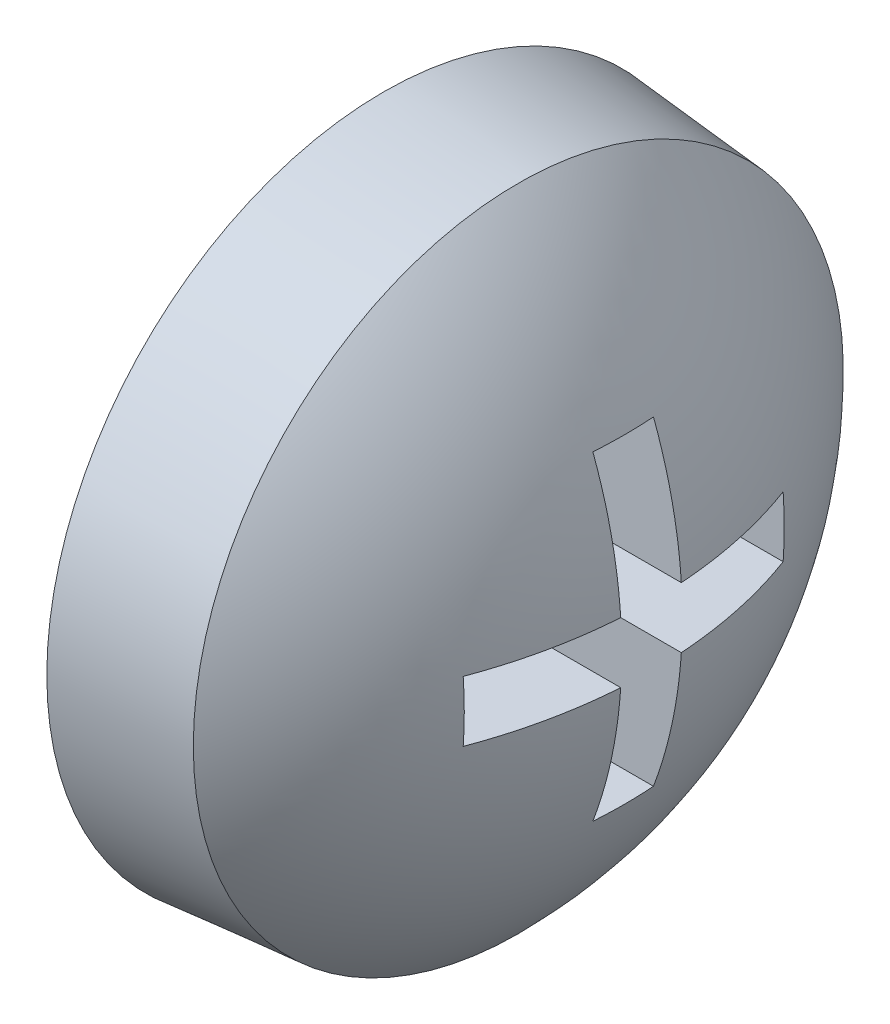
ISO-10303-21;
HEADER;
FILE_DESCRIPTION(('STEP AP214'),'2;1');
FILE_NAME('part.step','',(''),(''),'','','');
FILE_SCHEMA(('AUTOMOTIVE_DESIGN { 1 0 10303 214 1 1 1 1 }'));
ENDSEC;
DATA;
#1=APPLICATION_CONTEXT('core data for automotive mechanical design processes');
#2=APPLICATION_PROTOCOL_DEFINITION('international standard','automotive_design',2000,#1);
#3=PRODUCT_CONTEXT('',#1,'mechanical');
#4=PRODUCT('Part','Part','',(#3));
#5=PRODUCT_RELATED_PRODUCT_CATEGORY('part','',(#4));
#6=PRODUCT_DEFINITION_FORMATION('','',#4);
#7=PRODUCT_DEFINITION_CONTEXT('part definition',#1,'design');
#8=PRODUCT_DEFINITION('design','',#6,#7);
#9=PRODUCT_DEFINITION_SHAPE('','',#8);
#10=(LENGTH_UNIT() NAMED_UNIT(*) SI_UNIT(.MILLI.,.METRE.));
#11=(NAMED_UNIT(*) PLANE_ANGLE_UNIT() SI_UNIT($,.RADIAN.));
#12=(NAMED_UNIT(*) SI_UNIT($,.STERADIAN.) SOLID_ANGLE_UNIT());
#13=UNCERTAINTY_MEASURE_WITH_UNIT(LENGTH_MEASURE(1.E-05),#10,'distance_accuracy_value','');
#14=(GEOMETRIC_REPRESENTATION_CONTEXT(3) GLOBAL_UNCERTAINTY_ASSIGNED_CONTEXT((#13)) GLOBAL_UNIT_ASSIGNED_CONTEXT((#10,
#11,#12)) REPRESENTATION_CONTEXT('',''));
#15=CARTESIAN_POINT('',(0.,0.,0.));
#16=DIRECTION('',(0.,0.,1.));
#17=DIRECTION('',(1.,0.,0.));
#18=AXIS2_PLACEMENT_3D('',#15,#16,#17);
#19=CARTESIAN_POINT('',(103.933333333333,-6.9,10.));
#20=DIRECTION('',(1.,0.,0.));
#21=DIRECTION('',(0.,0.,-1.));
#22=AXIS2_PLACEMENT_3D('',#19,#20,#21);
#23=PLANE('',#22);
#24=DIRECTION('',(0.,0.,1.));
#25=VECTOR('',#24,1.);
#26=CARTESIAN_POINT('',(103.933333333333,-7.85,10.));
#27=LINE('',#26,#25);
#28=CARTESIAN_POINT('',(103.933333333333,-7.85,9.82));
#29=VERTEX_POINT('',#28);
#30=CARTESIAN_POINT('',(103.933333333333,-7.85,10.18));
#31=VERTEX_POINT('',#30);
#32=EDGE_CURVE('E293',#29,#31,#27,.T.);
#33=ORIENTED_EDGE('',*,*,#32,.F.);
#34=DIRECTION('',(0.,1.,0.));
#35=VECTOR('',#34,1.);
#36=CARTESIAN_POINT('',(103.933333333333,-6.9,9.82));
#37=LINE('',#36,#35);
#38=CARTESIAN_POINT('',(103.933333333333,-7.08,9.82));
#39=VERTEX_POINT('',#38);
#40=EDGE_CURVE('E298',#39,#29,#37,.F.);
#41=ORIENTED_EDGE('',*,*,#40,.F.);
#42=DIRECTION('',(0.,0.,1.));
#43=VECTOR('',#42,1.);
#44=CARTESIAN_POINT('',(103.933333333333,-7.08,10.));
#45=LINE('',#44,#43);
#46=CARTESIAN_POINT('',(103.933333333333,-7.08,9.05));
#47=VERTEX_POINT('',#46);
#48=EDGE_CURVE('E303',#47,#39,#45,.T.);
#49=ORIENTED_EDGE('',*,*,#48,.F.);
#50=DIRECTION('',(0.,1.,0.));
#51=VECTOR('',#50,1.);
#52=CARTESIAN_POINT('',(103.933333333333,-6.9,9.05));
#53=LINE('',#52,#51);
#54=CARTESIAN_POINT('',(103.933333333333,-6.72,9.05));
#55=VERTEX_POINT('',#54);
#56=EDGE_CURVE('E308',#55,#47,#53,.F.);
#57=ORIENTED_EDGE('',*,*,#56,.F.);
#58=DIRECTION('',(0.,0.,-1.));
#59=VECTOR('',#58,1.);
#60=CARTESIAN_POINT('',(103.933333333333,-6.72,10.));
#61=LINE('',#60,#59);
#62=CARTESIAN_POINT('',(103.933333333333,-6.72,9.82));
#63=VERTEX_POINT('',#62);
#64=EDGE_CURVE('E313',#63,#55,#61,.T.);
#65=ORIENTED_EDGE('',*,*,#64,.F.);
#66=DIRECTION('',(0.,1.,0.));
#67=VECTOR('',#66,1.);
#68=CARTESIAN_POINT('',(103.933333333333,-6.9,9.82));
#69=LINE('',#68,#67);
#70=CARTESIAN_POINT('',(103.933333333333,-5.95,9.82));
#71=VERTEX_POINT('',#70);
#72=EDGE_CURVE('E318',#71,#63,#69,.F.);
#73=ORIENTED_EDGE('',*,*,#72,.F.);
#74=DIRECTION('',(0.,0.,1.));
#75=VECTOR('',#74,1.);
#76=CARTESIAN_POINT('',(103.933333333333,-5.95,10.));
#77=LINE('',#76,#75);
#78=CARTESIAN_POINT('',(103.933333333333,-5.95,10.18));
#79=VERTEX_POINT('',#78);
#80=EDGE_CURVE('E267',#71,#79,#77,.T.);
#81=ORIENTED_EDGE('',*,*,#80,.T.);
#82=DIRECTION('',(0.,1.,0.));
#83=VECTOR('',#82,1.);
#84=CARTESIAN_POINT('',(103.933333333333,-6.9,10.18));
#85=LINE('',#84,#83);
#86=CARTESIAN_POINT('',(103.933333333333,-6.72,10.18));
#87=VERTEX_POINT('',#86);
#88=EDGE_CURVE('E264',#87,#79,#85,.T.);
#89=ORIENTED_EDGE('',*,*,#88,.F.);
#90=DIRECTION('',(0.,0.,-1.));
#91=VECTOR('',#90,1.);
#92=CARTESIAN_POINT('',(103.933333333333,-6.72,10.));
#93=LINE('',#92,#91);
#94=CARTESIAN_POINT('',(103.933333333333,-6.72,10.95));
#95=VERTEX_POINT('',#94);
#96=EDGE_CURVE('E260',#95,#87,#93,.T.);
#97=ORIENTED_EDGE('',*,*,#96,.F.);
#98=DIRECTION('',(0.,1.,0.));
#99=VECTOR('',#98,1.);
#100=CARTESIAN_POINT('',(103.933333333333,-6.9,10.95));
#101=LINE('',#100,#99);
#102=CARTESIAN_POINT('',(103.933333333333,-7.08,10.95));
#103=VERTEX_POINT('',#102);
#104=EDGE_CURVE('E231',#95,#103,#101,.F.);
#105=ORIENTED_EDGE('',*,*,#104,.T.);
#106=DIRECTION('',(0.,0.,1.));
#107=VECTOR('',#106,1.);
#108=CARTESIAN_POINT('',(103.933333333333,-7.08,10.));
#109=LINE('',#108,#107);
#110=CARTESIAN_POINT('',(103.933333333333,-7.08,10.18));
#111=VERTEX_POINT('',#110);
#112=EDGE_CURVE('E278',#111,#103,#109,.T.);
#113=ORIENTED_EDGE('',*,*,#112,.F.);
#114=DIRECTION('',(0.,1.,0.));
#115=VECTOR('',#114,1.);
#116=CARTESIAN_POINT('',(103.933333333333,-6.9,10.18));
#117=LINE('',#116,#115);
#118=EDGE_CURVE('E288',#31,#111,#117,.T.);
#119=ORIENTED_EDGE('',*,*,#118,.F.);
#120=EDGE_LOOP('',(#33,#41,#49,#57,#65,#73,#81,#89,#97,#105,#113,#119));
#121=FACE_BOUND('',#120,.T.);
#122=ADVANCED_FACE('F17',(#121),#23,.T.);
#123=CARTESIAN_POINT('',(104.533333333333,-6.72,10.));
#124=DIRECTION('',(0.,-1.,0.));
#125=DIRECTION('',(0.,0.,-1.));
#126=AXIS2_PLACEMENT_3D('',#123,#124,#125);
#127=PLANE('',#126);
#128=DIRECTION('',(1.,0.,0.));
#129=VECTOR('',#128,1.);
#130=CARTESIAN_POINT('',(104.533333333333,-6.72,10.95));
#131=LINE('',#130,#129);
#132=CARTESIAN_POINT('',(104.956237856524,-6.72,10.9500000000001));
#133=VERTEX_POINT('',#132);
#134=EDGE_CURVE('E89',#133,#95,#131,.F.);
#135=ORIENTED_EDGE('',*,*,#134,.T.);
#136=ORIENTED_EDGE('',*,*,#96,.T.);
#137=DIRECTION('',(-1.,0.,0.));
#138=VECTOR('',#137,1.);
#139=CARTESIAN_POINT('',(104.533333333333,-6.72,10.18));
#140=LINE('',#139,#138);
#141=CARTESIAN_POINT('',(105.121430903127,-6.71999999999999,10.18));
#142=VERTEX_POINT('',#141);
#143=EDGE_CURVE('E224',#142,#87,#140,.T.);
#144=ORIENTED_EDGE('',*,*,#143,.F.);
#145=CARTESIAN_POINT('',(104.956237856524,-6.72,10.9500000000001));
#146=CARTESIAN_POINT('',(104.967782870718,-6.72,10.9189995540507));
#147=CARTESIAN_POINT('',(104.978762253102,-6.72,10.8877884938069));
#148=CARTESIAN_POINT('',(104.99953545164,-6.72,10.825110453647));
#149=CARTESIAN_POINT('',(105.009333758651,-6.72,10.7936449620742));
#150=CARTESIAN_POINT('',(105.027757299291,-6.72,10.7304618501357));
#151=CARTESIAN_POINT('',(105.03638553892,-6.72,10.6987451062673));
#152=CARTESIAN_POINT('',(105.052477288087,-6.72,10.6350619663156));
#153=CARTESIAN_POINT('',(105.059942316909,-6.72,10.6030959541243));
#154=CARTESIAN_POINT('',(105.073711495295,-6.72,10.5389148788569));
#155=CARTESIAN_POINT('',(105.08001564486,-6.72,10.5066998157809));
#156=CARTESIAN_POINT('',(105.091462392225,-6.72,10.4420201537525));
#157=CARTESIAN_POINT('',(105.096603446971,-6.72,10.4095552817086));
#158=CARTESIAN_POINT('',(105.105718495644,-6.72,10.3443751591894));
#159=CARTESIAN_POINT('',(105.109689388573,-6.72,10.3116594750373));
#160=CARTESIAN_POINT('',(105.116454375482,-6.72,10.2459761632456));
#161=CARTESIAN_POINT('',(105.119243763301,-6.72,10.2130080508538));
#162=CARTESIAN_POINT('',(105.121430903127,-6.72,10.18));
#163=B_SPLINE_CURVE_WITH_KNOTS('',3,(#145,#146,#147,#148,#149,#150,#151,#152,#153,#154,#155,
#156,#157,#158,#159,#160,#161,#162),.UNSPECIFIED.,.F.,.F.,(4,2,2,2,2,2,2,2,4),(0.,
0.0992357442434335,0.1980813876393,0.296668072480546,0.395124892694163,0.493581712907778,
0.592168397749022,0.69101404114489,0.790249785388326),.UNSPECIFIED.);
#164=EDGE_CURVE('E20',#133,#142,#163,.T.);
#165=ORIENTED_EDGE('',*,*,#164,.F.);
#166=EDGE_LOOP('',(#135,#136,#144,#165));
#167=FACE_BOUND('',#166,.T.);
#168=ADVANCED_FACE('F221',(#167),#127,.T.);
#169=CARTESIAN_POINT('',(104.533333333333,-6.9,10.18));
#170=DIRECTION('',(0.,0.,-1.));
#171=DIRECTION('',(-1.,0.,0.));
#172=AXIS2_PLACEMENT_3D('',#169,#170,#171);
#173=PLANE('',#172);
#174=ORIENTED_EDGE('',*,*,#88,.T.);
#175=DIRECTION('',(1.,0.,0.));
#176=VECTOR('',#175,1.);
#177=CARTESIAN_POINT('',(104.533333333333,-5.95,10.18));
#178=LINE('',#177,#176);
#179=CARTESIAN_POINT('',(104.956237856524,-5.95,10.18));
#180=VERTEX_POINT('',#179);
#181=EDGE_CURVE('E324',#79,#180,#178,.T.);
#182=ORIENTED_EDGE('',*,*,#181,.T.);
#183=CARTESIAN_POINT('',(105.121430903127,-6.71999999999997,10.18));
#184=CARTESIAN_POINT('',(105.115776724439,-6.63440991744415,10.18));
#185=CARTESIAN_POINT('',(105.106045237039,-6.54909652262227,10.18));
#186=CARTESIAN_POINT('',(105.078678119522,-6.38034093840227,10.18));
#187=CARTESIAN_POINT('',(105.061096565483,-6.29688998051799,10.18));
#188=CARTESIAN_POINT('',(105.01636743592,-6.12495750840946,10.18));
#189=CARTESIAN_POINT('',(104.988531372825,-6.03665468899643,10.18));
#190=CARTESIAN_POINT('',(104.956237856524,-5.94999999999986,10.18));
#191=B_SPLINE_CURVE_WITH_KNOTS('',3,(#183,#184,#185,#186,#187,#188,#189,#190),.UNSPECIFIED.,.F.,
.F.,(4,2,2,4),(0.,0.257221658829358,0.51269811773739,0.789983486231739),.UNSPECIFIED.);
#192=EDGE_CURVE('E213',#142,#180,#191,.T.);
#193=ORIENTED_EDGE('',*,*,#192,.F.);
#194=ORIENTED_EDGE('',*,*,#143,.T.);
#195=EDGE_LOOP('',(#174,#182,#193,#194));
#196=FACE_BOUND('',#195,.T.);
#197=ADVANCED_FACE('F204',(#196),#173,.T.);
#198=CARTESIAN_POINT('',(104.533333333333,-5.95,10.));
#199=DIRECTION('',(0.,1.,0.));
#200=DIRECTION('',(0.,0.,1.));
#201=AXIS2_PLACEMENT_3D('',#198,#199,#200);
#202=PLANE('',#201);
#203=ORIENTED_EDGE('',*,*,#181,.F.);
#204=ORIENTED_EDGE('',*,*,#80,.F.);
#205=DIRECTION('',(1.,0.,0.));
#206=VECTOR('',#205,1.);
#207=CARTESIAN_POINT('',(104.533333333333,-5.95,9.82));
#208=LINE('',#207,#206);
#209=CARTESIAN_POINT('',(104.956237856524,-5.94999999999993,9.82));
#210=VERTEX_POINT('',#209);
#211=EDGE_CURVE('E320',#210,#71,#208,.F.);
#212=ORIENTED_EDGE('',*,*,#211,.F.);
#213=CARTESIAN_POINT('',(104.956237856524,-5.95,10.18));
#214=CARTESIAN_POINT('',(104.960466252223,-5.94999999999998,10.12));
#215=CARTESIAN_POINT('',(104.962580450072,-5.94999999999998,10.06));
#216=CARTESIAN_POINT('',(104.962580450072,-5.95000000000002,9.93999999999995));
#217=CARTESIAN_POINT('',(104.960466252223,-5.95000000000006,9.87999999999993));
#218=CARTESIAN_POINT('',(104.956237856524,-5.95000000000011,9.81999999999991));
#219=B_SPLINE_CURVE_WITH_KNOTS('',3,(#213,#214,#215,#216,#217,#218),.UNSPECIFIED.,.F.,.F.,(4,2,
4),(0.,0.18011171114875,0.3602234222975),.UNSPECIFIED.);
#220=EDGE_CURVE('E207',#180,#210,#219,.T.);
#221=ORIENTED_EDGE('',*,*,#220,.F.);
#222=EDGE_LOOP('',(#203,#204,#212,#221));
#223=FACE_BOUND('',#222,.T.);
#224=ADVANCED_FACE('F199',(#223),#202,.F.);
#225=CARTESIAN_POINT('',(104.533333333333,-6.9,9.82));
#226=DIRECTION('',(0.,0.,1.));
#227=DIRECTION('',(1.,0.,0.));
#228=AXIS2_PLACEMENT_3D('',#225,#226,#227);
#229=PLANE('',#228);
#230=ORIENTED_EDGE('',*,*,#72,.T.);
#231=DIRECTION('',(1.,0.,0.));
#232=VECTOR('',#231,1.);
#233=CARTESIAN_POINT('',(104.533333333333,-6.72,9.82));
#234=LINE('',#233,#232);
#235=CARTESIAN_POINT('',(105.121430903127,-6.72,9.81999999999999));
#236=VERTEX_POINT('',#235);
#237=EDGE_CURVE('E315',#236,#63,#234,.F.);
#238=ORIENTED_EDGE('',*,*,#237,.F.);
#239=CARTESIAN_POINT('',(104.956237856524,-5.94999999999986,9.82));
#240=CARTESIAN_POINT('',(104.967782870718,-5.98100044594928,9.82));
#241=CARTESIAN_POINT('',(104.978762253102,-6.01221150619314,9.82));
#242=CARTESIAN_POINT('',(104.99953545164,-6.07488954635303,9.82));
#243=CARTESIAN_POINT('',(105.009333758651,-6.10635503792583,9.82));
#244=CARTESIAN_POINT('',(105.027757299291,-6.1695381498643,9.82));
#245=CARTESIAN_POINT('',(105.03638553892,-6.20125489373266,9.82));
#246=CARTESIAN_POINT('',(105.052477288087,-6.2649380336844,9.82));
#247=CARTESIAN_POINT('',(105.059942316909,-6.29690404587573,9.82));
#248=CARTESIAN_POINT('',(105.073711495295,-6.36108512114309,9.82));
#249=CARTESIAN_POINT('',(105.08001564486,-6.39330018421913,9.82));
#250=CARTESIAN_POINT('',(105.091462392225,-6.45797984624755,9.82));
#251=CARTESIAN_POINT('',(105.096603446971,-6.49044471829137,9.82));
#252=CARTESIAN_POINT('',(105.105718495644,-6.55562484081063,9.82));
#253=CARTESIAN_POINT('',(105.109689388573,-6.58834052496273,9.82));
#254=CARTESIAN_POINT('',(105.116454375482,-6.65402383675437,9.82));
#255=CARTESIAN_POINT('',(105.119243763301,-6.68699194914619,9.82));
#256=CARTESIAN_POINT('',(105.121430903127,-6.71999999999998,9.82));
#257=B_SPLINE_CURVE_WITH_KNOTS('',3,(#239,#240,#241,#242,#243,#244,#245,#246,#247,#248,#249,
#250,#251,#252,#253,#254,#255,#256),.UNSPECIFIED.,.F.,.F.,(4,2,2,2,2,2,2,2,4),(0.,
0.0992357442434327,0.198081387639304,0.296668072480546,0.395124892694164,0.49358171290778,
0.592168397749023,0.691014041144893,0.790249785388327),.UNSPECIFIED.);
#258=EDGE_CURVE('E184',#210,#236,#257,.T.);
#259=ORIENTED_EDGE('',*,*,#258,.F.);
#260=ORIENTED_EDGE('',*,*,#211,.T.);
#261=EDGE_LOOP('',(#230,#238,#259,#260));
#262=FACE_BOUND('',#261,.T.);
#263=ADVANCED_FACE('F194',(#262),#229,.T.);
#264=CARTESIAN_POINT('',(104.533333333333,-6.72,10.));
#265=DIRECTION('',(0.,-1.,0.));
#266=DIRECTION('',(0.,0.,-1.));
#267=AXIS2_PLACEMENT_3D('',#264,#265,#266);
#268=PLANE('',#267);
#269=DIRECTION('',(1.,0.,0.));
#270=VECTOR('',#269,1.);
#271=CARTESIAN_POINT('',(104.533333333333,-6.72,9.05));
#272=LINE('',#271,#270);
#273=CARTESIAN_POINT('',(104.956237856524,-6.72,9.05));
#274=VERTEX_POINT('',#273);
#275=EDGE_CURVE('E310',#274,#55,#272,.F.);
#276=ORIENTED_EDGE('',*,*,#275,.F.);
#277=CARTESIAN_POINT('',(105.121430903127,-6.72,9.81999999999998));
#278=CARTESIAN_POINT('',(105.115776724439,-6.72,9.73440991744415));
#279=CARTESIAN_POINT('',(105.106045237039,-6.72,9.64909652262228));
#280=CARTESIAN_POINT('',(105.078678119522,-6.72,9.48034093840227));
#281=CARTESIAN_POINT('',(105.061096565483,-6.72,9.396889980518));
#282=CARTESIAN_POINT('',(105.01636743592,-6.72,9.22495750840946));
#283=CARTESIAN_POINT('',(104.988531372825,-6.72,9.13665468899643));
#284=CARTESIAN_POINT('',(104.956237856524,-6.72,9.04999999999986));
#285=B_SPLINE_CURVE_WITH_KNOTS('',3,(#277,#278,#279,#280,#281,#282,#283,#284),.UNSPECIFIED.,.F.,
.F.,(4,2,2,4),(0.,0.257221658829357,0.512698117737388,0.789983486231741),.UNSPECIFIED.);
#286=EDGE_CURVE('E176',#236,#274,#285,.T.);
#287=ORIENTED_EDGE('',*,*,#286,.F.);
#288=ORIENTED_EDGE('',*,*,#237,.T.);
#289=ORIENTED_EDGE('',*,*,#64,.T.);
#290=EDGE_LOOP('',(#276,#287,#288,#289));
#291=FACE_BOUND('',#290,.T.);
#292=ADVANCED_FACE('F191',(#291),#268,.T.);
#293=CARTESIAN_POINT('',(104.533333333333,-6.9,9.05));
#294=DIRECTION('',(0.,0.,1.));
#295=DIRECTION('',(1.,0.,0.));
#296=AXIS2_PLACEMENT_3D('',#293,#294,#295);
#297=PLANE('',#296);
#298=DIRECTION('',(1.,0.,0.));
#299=VECTOR('',#298,1.);
#300=CARTESIAN_POINT('',(104.533333333333,-7.08,9.05));
#301=LINE('',#300,#299);
#302=CARTESIAN_POINT('',(104.956237856524,-7.08,9.04999999999993));
#303=VERTEX_POINT('',#302);
#304=EDGE_CURVE('E305',#303,#47,#301,.F.);
#305=ORIENTED_EDGE('',*,*,#304,.F.);
#306=CARTESIAN_POINT('',(104.956237856524,-7.08,9.05));
#307=CARTESIAN_POINT('',(104.962580450072,-6.99011174581251,9.05));
#308=CARTESIAN_POINT('',(104.962580450072,-6.9,9.05));
#309=B_SPLINE_CURVE_WITH_KNOTS('',2,(#306,#307,#308),.UNSPECIFIED.,.F.,.F.,(3,3),(0.,1.),.UNSPECIFIED.);
#310=CARTESIAN_POINT('',(104.962580450072,-6.9,9.05));
#311=VERTEX_POINT('',#310);
#312=EDGE_CURVE('E175',#311,#303,#309,.F.);
#313=ORIENTED_EDGE('',*,*,#312,.F.);
#314=CARTESIAN_POINT('',(104.962580450072,-6.9,9.05));
#315=CARTESIAN_POINT('',(104.962580450072,-6.80988825418749,9.05));
#316=CARTESIAN_POINT('',(104.956237856524,-6.72,9.05));
#317=B_SPLINE_CURVE_WITH_KNOTS('',2,(#314,#315,#316),.UNSPECIFIED.,.F.,.F.,(3,3),(0.,1.),.UNSPECIFIED.);
#318=EDGE_CURVE('E183',#274,#311,#317,.F.);
#319=ORIENTED_EDGE('',*,*,#318,.F.);
#320=ORIENTED_EDGE('',*,*,#275,.T.);
#321=ORIENTED_EDGE('',*,*,#56,.T.);
#322=EDGE_LOOP('',(#305,#313,#319,#320,#321));
#323=FACE_BOUND('',#322,.T.);
#324=ADVANCED_FACE('F164',(#323),#297,.T.);
#325=CARTESIAN_POINT('',(104.533333333333,-7.08,10.));
#326=DIRECTION('',(0.,1.,0.));
#327=DIRECTION('',(0.,0.,1.));
#328=AXIS2_PLACEMENT_3D('',#325,#326,#327);
#329=PLANE('',#328);
#330=ORIENTED_EDGE('',*,*,#304,.T.);
#331=ORIENTED_EDGE('',*,*,#48,.T.);
#332=DIRECTION('',(1.,0.,0.));
#333=VECTOR('',#332,1.);
#334=CARTESIAN_POINT('',(104.533333333333,-7.08,9.82));
#335=LINE('',#334,#333);
#336=CARTESIAN_POINT('',(105.121430903127,-7.08000000000001,9.82));
#337=VERTEX_POINT('',#336);
#338=EDGE_CURVE('E300',#337,#39,#335,.F.);
#339=ORIENTED_EDGE('',*,*,#338,.F.);
#340=CARTESIAN_POINT('',(104.956237856524,-7.08,9.04999999999986));
#341=CARTESIAN_POINT('',(104.967782870718,-7.08,9.08100044594928));
#342=CARTESIAN_POINT('',(104.978762253102,-7.08,9.11221150619314));
#343=CARTESIAN_POINT('',(104.99953545164,-7.08,9.17488954635303));
#344=CARTESIAN_POINT('',(105.009333758651,-7.08,9.20635503792583));
#345=CARTESIAN_POINT('',(105.027757299291,-7.08,9.2695381498643));
#346=CARTESIAN_POINT('',(105.03638553892,-7.08,9.30125489373266));
#347=CARTESIAN_POINT('',(105.052477288087,-7.08,9.36493803368441));
#348=CARTESIAN_POINT('',(105.059942316909,-7.08,9.39690404587573));
#349=CARTESIAN_POINT('',(105.073711495295,-7.08,9.46108512114309));
#350=CARTESIAN_POINT('',(105.08001564486,-7.08,9.49330018421913));
#351=CARTESIAN_POINT('',(105.091462392225,-7.08,9.55797984624755));
#352=CARTESIAN_POINT('',(105.096603446971,-7.08,9.59044471829138));
#353=CARTESIAN_POINT('',(105.105718495644,-7.08,9.65562484081063));
#354=CARTESIAN_POINT('',(105.109689388573,-7.08,9.68834052496273));
#355=CARTESIAN_POINT('',(105.116454375482,-7.08,9.75402383675437));
#356=CARTESIAN_POINT('',(105.119243763301,-7.08,9.78699194914619));
#357=CARTESIAN_POINT('',(105.121430903127,-7.08,9.81999999999998));
#358=B_SPLINE_CURVE_WITH_KNOTS('',3,(#340,#341,#342,#343,#344,#345,#346,#347,#348,#349,#350,
#351,#352,#353,#354,#355,#356,#357),.UNSPECIFIED.,.F.,.F.,(4,2,2,2,2,2,2,2,4),(0.,
0.0992357442434318,0.198081387639298,0.296668072480553,0.395124892694166,0.493581712907782,
0.592168397749024,0.691014041144892,0.790249785388328),.UNSPECIFIED.);
#359=EDGE_CURVE('E168',#303,#337,#358,.T.);
#360=ORIENTED_EDGE('',*,*,#359,.F.);
#361=EDGE_LOOP('',(#330,#331,#339,#360));
#362=FACE_BOUND('',#361,.T.);
#363=ADVANCED_FACE('F159',(#362),#329,.T.);
#364=CARTESIAN_POINT('',(104.533333333333,-6.9,9.82));
#365=DIRECTION('',(0.,0.,1.));
#366=DIRECTION('',(1.,0.,0.));
#367=AXIS2_PLACEMENT_3D('',#364,#365,#366);
#368=PLANE('',#367);
#369=ORIENTED_EDGE('',*,*,#40,.T.);
#370=DIRECTION('',(1.,0.,0.));
#371=VECTOR('',#370,1.);
#372=CARTESIAN_POINT('',(104.533333333333,-7.85,9.82));
#373=LINE('',#372,#371);
#374=CARTESIAN_POINT('',(104.956237856524,-7.85,9.81999999999998));
#375=VERTEX_POINT('',#374);
#376=EDGE_CURVE('E295',#375,#29,#373,.F.);
#377=ORIENTED_EDGE('',*,*,#376,.F.);
#378=CARTESIAN_POINT('',(105.121430903127,-7.08000000000003,9.82));
#379=CARTESIAN_POINT('',(105.115776724439,-7.16559008255585,9.82));
#380=CARTESIAN_POINT('',(105.106045237039,-7.25090347737772,9.82));
#381=CARTESIAN_POINT('',(105.078678119522,-7.41965906159773,9.82));
#382=CARTESIAN_POINT('',(105.061096565483,-7.503110019482,9.82));
#383=CARTESIAN_POINT('',(105.01636743592,-7.67504249159054,9.82));
#384=CARTESIAN_POINT('',(104.988531372825,-7.76334531100357,9.82));
#385=CARTESIAN_POINT('',(104.956237856524,-7.85000000000015,9.82));
#386=B_SPLINE_CURVE_WITH_KNOTS('',3,(#378,#379,#380,#381,#382,#383,#384,#385),.UNSPECIFIED.,.F.,
.F.,(4,2,2,4),(0.,0.257221658829356,0.512698117737386,0.789983486231741),.UNSPECIFIED.);
#387=EDGE_CURVE('E144',#337,#375,#386,.T.);
#388=ORIENTED_EDGE('',*,*,#387,.F.);
#389=ORIENTED_EDGE('',*,*,#338,.T.);
#390=EDGE_LOOP('',(#369,#377,#388,#389));
#391=FACE_BOUND('',#390,.T.);
#392=ADVANCED_FACE('F154',(#391),#368,.T.);
#393=CARTESIAN_POINT('',(104.533333333333,-7.85,10.));
#394=DIRECTION('',(0.,1.,0.));
#395=DIRECTION('',(0.,0.,1.));
#396=AXIS2_PLACEMENT_3D('',#393,#394,#395);
#397=PLANE('',#396);
#398=ORIENTED_EDGE('',*,*,#32,.T.);
#399=DIRECTION('',(-1.,0.,0.));
#400=VECTOR('',#399,1.);
#401=CARTESIAN_POINT('',(104.533333333333,-7.85,10.18));
#402=LINE('',#401,#400);
#403=CARTESIAN_POINT('',(104.956237856524,-7.85000000000007,10.18));
#404=VERTEX_POINT('',#403);
#405=EDGE_CURVE('E290',#404,#31,#402,.T.);
#406=ORIENTED_EDGE('',*,*,#405,.F.);
#407=CARTESIAN_POINT('',(104.956237856524,-7.85,9.81999999999997));
#408=CARTESIAN_POINT('',(104.960466252223,-7.85000000000001,9.87999999999999));
#409=CARTESIAN_POINT('',(104.962580450072,-7.85000000000001,9.94000000000001));
#410=CARTESIAN_POINT('',(104.962580450072,-7.84999999999999,10.0600000000001));
#411=CARTESIAN_POINT('',(104.960466252223,-7.84999999999997,10.1200000000001));
#412=CARTESIAN_POINT('',(104.956237856524,-7.84999999999994,10.1800000000001));
#413=B_SPLINE_CURVE_WITH_KNOTS('',3,(#407,#408,#409,#410,#411,#412),.UNSPECIFIED.,.F.,.F.,(4,2,
4),(0.,0.180111711148751,0.3602234222975),.UNSPECIFIED.);
#414=EDGE_CURVE('E137',#375,#404,#413,.T.);
#415=ORIENTED_EDGE('',*,*,#414,.F.);
#416=ORIENTED_EDGE('',*,*,#376,.T.);
#417=EDGE_LOOP('',(#398,#406,#415,#416));
#418=FACE_BOUND('',#417,.T.);
#419=ADVANCED_FACE('F151',(#418),#397,.T.);
#420=CARTESIAN_POINT('',(104.533333333333,-6.9,10.18));
#421=DIRECTION('',(0.,0.,-1.));
#422=DIRECTION('',(-1.,0.,0.));
#423=AXIS2_PLACEMENT_3D('',#420,#421,#422);
#424=PLANE('',#423);
#425=ORIENTED_EDGE('',*,*,#118,.T.);
#426=DIRECTION('',(1.,0.,0.));
#427=VECTOR('',#426,1.);
#428=CARTESIAN_POINT('',(104.533333333333,-7.08,10.18));
#429=LINE('',#428,#427);
#430=CARTESIAN_POINT('',(105.121430903127,-7.08,10.18));
#431=VERTEX_POINT('',#430);
#432=EDGE_CURVE('E280',#431,#111,#429,.F.);
#433=ORIENTED_EDGE('',*,*,#432,.F.);
#434=CARTESIAN_POINT('',(104.956237856524,-7.85000000000015,10.18));
#435=CARTESIAN_POINT('',(104.967782870718,-7.81899955405072,10.18));
#436=CARTESIAN_POINT('',(104.978762253102,-7.78778849380686,10.18));
#437=CARTESIAN_POINT('',(104.99953545164,-7.72511045364697,10.18));
#438=CARTESIAN_POINT('',(105.009333758651,-7.69364496207417,10.18));
#439=CARTESIAN_POINT('',(105.027757299291,-7.6304618501357,10.18));
#440=CARTESIAN_POINT('',(105.03638553892,-7.59874510626734,10.18));
#441=CARTESIAN_POINT('',(105.052477288087,-7.5350619663156,10.18));
#442=CARTESIAN_POINT('',(105.059942316909,-7.50309595412427,10.18));
#443=CARTESIAN_POINT('',(105.073711495295,-7.43891487885691,10.18));
#444=CARTESIAN_POINT('',(105.08001564486,-7.40669981578087,10.18));
#445=CARTESIAN_POINT('',(105.091462392225,-7.34202015375245,10.18));
#446=CARTESIAN_POINT('',(105.096603446971,-7.30955528170863,10.18));
#447=CARTESIAN_POINT('',(105.105718495644,-7.24437515918937,10.18));
#448=CARTESIAN_POINT('',(105.109689388573,-7.21165947503727,10.18));
#449=CARTESIAN_POINT('',(105.116454375482,-7.14597616324564,10.18));
#450=CARTESIAN_POINT('',(105.119243763301,-7.11300805085381,10.18));
#451=CARTESIAN_POINT('',(105.121430903127,-7.08000000000002,10.18));
#452=B_SPLINE_CURVE_WITH_KNOTS('',3,(#434,#435,#436,#437,#438,#439,#440,#441,#442,#443,#444,
#445,#446,#447,#448,#449,#450,#451),.UNSPECIFIED.,.F.,.F.,(4,2,2,2,2,2,2,2,4),(0.,
0.0992357442434327,0.198081387639301,0.296668072480545,0.395124892694163,0.493581712907779,
0.592168397749022,0.691014041144891,0.790249785388326),.UNSPECIFIED.);
#453=EDGE_CURVE('E100',#404,#431,#452,.T.);
#454=ORIENTED_EDGE('',*,*,#453,.F.);
#455=ORIENTED_EDGE('',*,*,#405,.T.);
#456=EDGE_LOOP('',(#425,#433,#454,#455));
#457=FACE_BOUND('',#456,.T.);
#458=ADVANCED_FACE('F123',(#457),#424,.T.);
#459=CARTESIAN_POINT('',(104.533333333333,-7.08,10.));
#460=DIRECTION('',(0.,1.,0.));
#461=DIRECTION('',(0.,0.,1.));
#462=AXIS2_PLACEMENT_3D('',#459,#460,#461);
#463=PLANE('',#462);
#464=DIRECTION('',(1.,0.,0.));
#465=VECTOR('',#464,1.);
#466=CARTESIAN_POINT('',(104.533333333333,-7.08,10.95));
#467=LINE('',#466,#465);
#468=CARTESIAN_POINT('',(104.956237856524,-7.08,10.95));
#469=VERTEX_POINT('',#468);
#470=EDGE_CURVE('E40',#103,#469,#467,.T.);
#471=ORIENTED_EDGE('',*,*,#470,.T.);
#472=CARTESIAN_POINT('',(105.121430903127,-7.08,10.18));
#473=CARTESIAN_POINT('',(105.115776724439,-7.08,10.2655900825558));
#474=CARTESIAN_POINT('',(105.106045237039,-7.08,10.3509034773777));
#475=CARTESIAN_POINT('',(105.078678119522,-7.08,10.5196590615977));
#476=CARTESIAN_POINT('',(105.061096565483,-7.08,10.603110019482));
#477=CARTESIAN_POINT('',(105.01636743592,-7.08,10.7750424915905));
#478=CARTESIAN_POINT('',(104.988531372825,-7.08,10.8633453110036));
#479=CARTESIAN_POINT('',(104.956237856524,-7.08,10.9500000000001));
#480=B_SPLINE_CURVE_WITH_KNOTS('',3,(#472,#473,#474,#475,#476,#477,#478,#479),.UNSPECIFIED.,.F.,
.F.,(4,2,2,4),(0.,0.257221658829358,0.512698117737389,0.789983486231738),.UNSPECIFIED.);
#481=EDGE_CURVE('E96',#431,#469,#480,.T.);
#482=ORIENTED_EDGE('',*,*,#481,.F.);
#483=ORIENTED_EDGE('',*,*,#432,.T.);
#484=ORIENTED_EDGE('',*,*,#112,.T.);
#485=EDGE_LOOP('',(#471,#482,#483,#484));
#486=FACE_BOUND('',#485,.T.);
#487=ADVANCED_FACE('F115',(#486),#463,.T.);
#488=CARTESIAN_POINT('',(104.533333333333,-6.9,10.95));
#489=DIRECTION('',(0.,0.,1.));
#490=DIRECTION('',(1.,0.,0.));
#491=AXIS2_PLACEMENT_3D('',#488,#489,#490);
#492=PLANE('',#491);
#493=ORIENTED_EDGE('',*,*,#470,.F.);
#494=ORIENTED_EDGE('',*,*,#104,.F.);
#495=ORIENTED_EDGE('',*,*,#134,.F.);
#496=CARTESIAN_POINT('',(104.962580450072,-6.9,10.95));
#497=CARTESIAN_POINT('',(104.962580450072,-6.80988825418749,10.95));
#498=CARTESIAN_POINT('',(104.956237856524,-6.72,10.95));
#499=B_SPLINE_CURVE_WITH_KNOTS('',2,(#496,#497,#498),.UNSPECIFIED.,.F.,.F.,(3,3),(0.,1.),.UNSPECIFIED.);
#500=CARTESIAN_POINT('',(104.962580450072,-6.9,10.95));
#501=VERTEX_POINT('',#500);
#502=EDGE_CURVE('E82',#501,#133,#499,.T.);
#503=ORIENTED_EDGE('',*,*,#502,.F.);
#504=CARTESIAN_POINT('',(104.956237856524,-7.08,10.95));
#505=CARTESIAN_POINT('',(104.962580450072,-6.99011174581251,10.95));
#506=CARTESIAN_POINT('',(104.962580450072,-6.9,10.95));
#507=B_SPLINE_CURVE_WITH_KNOTS('',2,(#504,#505,#506),.UNSPECIFIED.,.F.,.F.,(3,3),(0.,1.),.UNSPECIFIED.);
#508=EDGE_CURVE('E85',#469,#501,#507,.T.);
#509=ORIENTED_EDGE('',*,*,#508,.F.);
#510=EDGE_LOOP('',(#493,#494,#495,#503,#509));
#511=FACE_BOUND('',#510,.T.);
#512=ADVANCED_FACE('F84',(#511),#492,.F.);
#513=CARTESIAN_POINT('',(102.405248953887,-6.9,10.));
#514=DIRECTION('',(1.,0.,0.));
#515=DIRECTION('',(0.,1.,0.));
#516=AXIS2_PLACEMENT_3D('',#513,#514,#515);
#517=SPHERICAL_SURFACE('',#516,2.72808437944638);
#518=CARTESIAN_POINT('',(104.333333333329,-6.9,10.));
#519=DIRECTION('',(-1.,0.,0.));
#520=DIRECTION('',(0.,0.,1.));
#521=AXIS2_PLACEMENT_3D('',#518,#519,#520);
#522=CIRCLE('',#521,1.93000906917518);
#523=CARTESIAN_POINT('',(104.333333333329,-6.90000000000007,11.9300090691752));
#524=VERTEX_POINT('',#523);
#525=EDGE_CURVE('E31',#524,#524,#522,.T.);
#526=ORIENTED_EDGE('',*,*,#525,.F.);
#527=EDGE_LOOP('',(#526));
#528=FACE_BOUND('',#527,.T.);
#529=ORIENTED_EDGE('',*,*,#481,.T.);
#530=ORIENTED_EDGE('',*,*,#508,.T.);
#531=ORIENTED_EDGE('',*,*,#502,.T.);
#532=ORIENTED_EDGE('',*,*,#164,.T.);
#533=ORIENTED_EDGE('',*,*,#192,.T.);
#534=ORIENTED_EDGE('',*,*,#220,.T.);
#535=ORIENTED_EDGE('',*,*,#258,.T.);
#536=ORIENTED_EDGE('',*,*,#286,.T.);
#537=ORIENTED_EDGE('',*,*,#318,.T.);
#538=ORIENTED_EDGE('',*,*,#312,.T.);
#539=ORIENTED_EDGE('',*,*,#359,.T.);
#540=ORIENTED_EDGE('',*,*,#387,.T.);
#541=ORIENTED_EDGE('',*,*,#414,.T.);
#542=ORIENTED_EDGE('',*,*,#453,.T.);
#543=EDGE_LOOP('',(#529,#530,#531,#532,#533,#534,#535,#536,#537,#538,#539,#540,#541,#542));
#544=FACE_BOUND('',#543,.T.);
#545=ADVANCED_FACE('F94',(#528,#544),#517,.T.);
#546=CARTESIAN_POINT('',(103.53333333336,-6.9,10.));
#547=DIRECTION('',(-1.,0.,0.));
#548=DIRECTION('',(0.,-1.,0.));
#549=AXIS2_PLACEMENT_3D('',#546,#547,#548);
#550=CONICAL_SURFACE('',#549,1.99999999999335,0.0872664625998096);
#551=CARTESIAN_POINT('',(103.53333333336,-6.9,10.));
#552=DIRECTION('',(-1.,0.,0.));
#553=DIRECTION('',(0.,-1.,0.));
#554=AXIS2_PLACEMENT_3D('',#551,#552,#553);
#555=CIRCLE('',#554,1.99999999999335);
#556=CARTESIAN_POINT('',(103.53333333336,-8.89999999999335,10.));
#557=VERTEX_POINT('',#556);
#558=EDGE_CURVE('E11',#557,#557,#555,.T.);
#559=ORIENTED_EDGE('',*,*,#558,.F.);
#560=EDGE_LOOP('',(#559));
#561=FACE_BOUND('',#560,.T.);
#562=ORIENTED_EDGE('',*,*,#525,.T.);
#563=EDGE_LOOP('',(#562));
#564=FACE_BOUND('',#563,.T.);
#565=ADVANCED_FACE('F402',(#561,#564),#550,.T.);
#566=CARTESIAN_POINT('',(103.533333333333,-6.9,11.));
#567=DIRECTION('',(-1.,0.,0.));
#568=DIRECTION('',(0.,0.,1.));
#569=AXIS2_PLACEMENT_3D('',#566,#567,#568);
#570=PLANE('',#569);
#571=ORIENTED_EDGE('',*,*,#558,.T.);
#572=EDGE_LOOP('',(#571));
#573=FACE_BOUND('',#572,.T.);
#574=ADVANCED_FACE('F400',(#573),#570,.T.);
#575=CLOSED_SHELL('',(#122,#168,#197,#224,#263,#292,#324,#363,#392,#419,#458,#487,#512,#545,
#565,#574));
#576=MANIFOLD_SOLID_BREP('B1',#575);
#577=ADVANCED_BREP_SHAPE_REPRESENTATION('',(#18,#576),#14);
#578=SHAPE_DEFINITION_REPRESENTATION(#9,#577);
ENDSEC;
END-ISO-10303-21;
